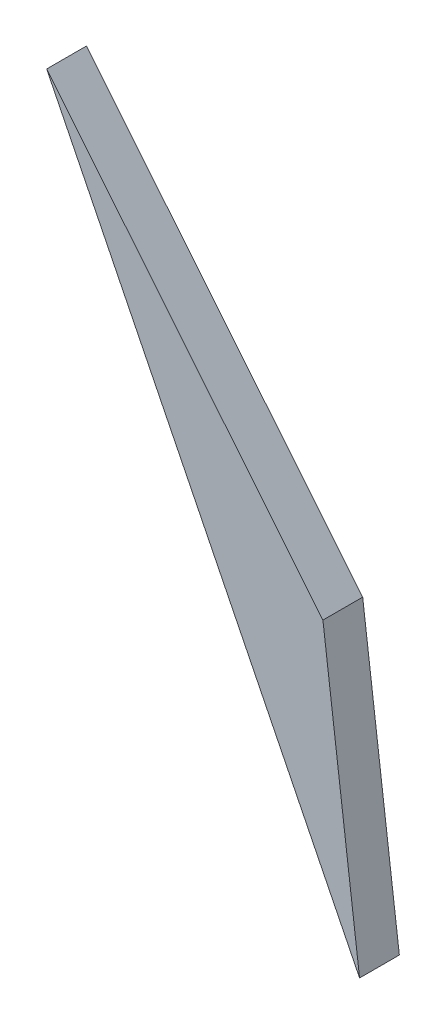
ISO-10303-21;
HEADER;
FILE_DESCRIPTION(('STEP AP214'),'2;1');
FILE_NAME('part.step','',(''),(''),'','','');
FILE_SCHEMA(('AUTOMOTIVE_DESIGN { 1 0 10303 214 1 1 1 1 }'));
ENDSEC;
DATA;
#1=APPLICATION_CONTEXT('core data for automotive mechanical design processes');
#2=APPLICATION_PROTOCOL_DEFINITION('international standard','automotive_design',2000,#1);
#3=PRODUCT_CONTEXT('',#1,'mechanical');
#4=PRODUCT('Part','Part','',(#3));
#5=PRODUCT_RELATED_PRODUCT_CATEGORY('part','',(#4));
#6=PRODUCT_DEFINITION_FORMATION('','',#4);
#7=PRODUCT_DEFINITION_CONTEXT('part definition',#1,'design');
#8=PRODUCT_DEFINITION('design','',#6,#7);
#9=PRODUCT_DEFINITION_SHAPE('','',#8);
#10=(LENGTH_UNIT() NAMED_UNIT(*) SI_UNIT(.MILLI.,.METRE.));
#11=(NAMED_UNIT(*) PLANE_ANGLE_UNIT() SI_UNIT($,.RADIAN.));
#12=(NAMED_UNIT(*) SI_UNIT($,.STERADIAN.) SOLID_ANGLE_UNIT());
#13=UNCERTAINTY_MEASURE_WITH_UNIT(LENGTH_MEASURE(1.E-05),#10,'distance_accuracy_value','');
#14=(GEOMETRIC_REPRESENTATION_CONTEXT(3) GLOBAL_UNCERTAINTY_ASSIGNED_CONTEXT((#13)) GLOBAL_UNIT_ASSIGNED_CONTEXT((#10,
#11,#12)) REPRESENTATION_CONTEXT('',''));
#15=CARTESIAN_POINT('',(0.,0.,0.));
#16=DIRECTION('',(0.,0.,1.));
#17=DIRECTION('',(1.,0.,0.));
#18=AXIS2_PLACEMENT_3D('',#15,#16,#17);
#19=CARTESIAN_POINT('',(-23.7102959440775,24.3585192257411,3.));
#20=DIRECTION('',(0.895829345995616,0.444398225528712,0.));
#21=DIRECTION('',(-0.444398225528712,0.895829345995616,0.));
#22=AXIS2_PLACEMENT_3D('',#19,#20,#21);
#23=PLANE('',#22);
#24=DIRECTION('',(0.444398225528712,-0.895829345995615,0.));
#25=VECTOR('',#24,1.);
#26=CARTESIAN_POINT('',(-23.7102959440775,24.3585192257411,0.));
#27=LINE('',#26,#25);
#28=CARTESIAN_POINT('',(-23.7102959440775,24.3585192257411,0.));
#29=VERTEX_POINT('',#28);
#30=CARTESIAN_POINT('',(-0.103997955508419,-23.2276619821565,0.));
#31=VERTEX_POINT('',#30);
#32=EDGE_CURVE('E80',#29,#31,#27,.T.);
#33=ORIENTED_EDGE('',*,*,#32,.T.);
#34=DIRECTION('',(0.,0.,-1.));
#35=VECTOR('',#34,1.);
#36=CARTESIAN_POINT('',(-0.103997955508419,-23.2276619821565,3.));
#37=LINE('',#36,#35);
#38=CARTESIAN_POINT('',(-0.103997955508419,-23.2276619821565,3.));
#39=VERTEX_POINT('',#38);
#40=EDGE_CURVE('E11',#39,#31,#37,.T.);
#41=ORIENTED_EDGE('',*,*,#40,.F.);
#42=DIRECTION('',(0.444398225528712,-0.895829345995615,0.));
#43=VECTOR('',#42,1.);
#44=CARTESIAN_POINT('',(-23.7102959440775,24.3585192257411,3.));
#45=LINE('',#44,#43);
#46=CARTESIAN_POINT('',(-23.7102959440775,24.3585192257411,3.));
#47=VERTEX_POINT('',#46);
#48=EDGE_CURVE('E73',#47,#39,#45,.T.);
#49=ORIENTED_EDGE('',*,*,#48,.F.);
#50=DIRECTION('',(0.,0.,-1.));
#51=VECTOR('',#50,1.);
#52=CARTESIAN_POINT('',(-23.7102959440775,24.3585192257411,3.));
#53=LINE('',#52,#51);
#54=EDGE_CURVE('E81',#47,#29,#53,.T.);
#55=ORIENTED_EDGE('',*,*,#54,.T.);
#56=EDGE_LOOP('',(#33,#41,#49,#55));
#57=FACE_BOUND('',#56,.T.);
#58=ADVANCED_FACE('F33',(#57),#23,.F.);
#59=CARTESIAN_POINT('',(-0.103997955508419,-23.2276619821565,3.));
#60=DIRECTION('',(-0.992192735918911,-0.124713971910708,0.));
#61=DIRECTION('',(0.124713971910708,-0.992192735918912,0.));
#62=AXIS2_PLACEMENT_3D('',#59,#60,#61);
#63=PLANE('',#62);
#64=DIRECTION('',(-0.124713971910708,0.992192735918912,0.));
#65=VECTOR('',#64,1.);
#66=CARTESIAN_POINT('',(-0.103997955508419,-23.2276619821565,0.));
#67=LINE('',#66,#65);
#68=CARTESIAN_POINT('',(-2.86929473980156,-1.22766198215647,0.));
#69=VERTEX_POINT('',#68);
#70=EDGE_CURVE('E61',#31,#69,#67,.T.);
#71=ORIENTED_EDGE('',*,*,#70,.T.);
#72=DIRECTION('',(0.,0.,-1.));
#73=VECTOR('',#72,1.);
#74=CARTESIAN_POINT('',(-2.86929473980156,-1.22766198215647,3.));
#75=LINE('',#74,#73);
#76=CARTESIAN_POINT('',(-2.86929473980156,-1.22766198215647,3.));
#77=VERTEX_POINT('',#76);
#78=EDGE_CURVE('E41',#77,#69,#75,.T.);
#79=ORIENTED_EDGE('',*,*,#78,.F.);
#80=DIRECTION('',(-0.124713971910708,0.992192735918912,0.));
#81=VECTOR('',#80,1.);
#82=CARTESIAN_POINT('',(-0.103997955508419,-23.2276619821565,3.));
#83=LINE('',#82,#81);
#84=EDGE_CURVE('E69',#39,#77,#83,.T.);
#85=ORIENTED_EDGE('',*,*,#84,.F.);
#86=ORIENTED_EDGE('',*,*,#40,.T.);
#87=EDGE_LOOP('',(#71,#79,#85,#86));
#88=FACE_BOUND('',#87,.T.);
#89=ADVANCED_FACE('F70',(#88),#63,.F.);
#90=CARTESIAN_POINT('',(-2.86929473980156,-1.22766198215647,3.));
#91=DIRECTION('',(-0.775338824481744,-0.631545491038663,0.));
#92=DIRECTION('',(0.631545491038664,-0.775338824481745,0.));
#93=AXIS2_PLACEMENT_3D('',#90,#91,#92);
#94=PLANE('',#93);
#95=DIRECTION('',(-0.631545491038664,0.775338824481745,0.));
#96=VECTOR('',#95,1.);
#97=CARTESIAN_POINT('',(-2.86929473980156,-1.22766198215647,0.));
#98=LINE('',#97,#96);
#99=EDGE_CURVE('E66',#69,#29,#98,.T.);
#100=ORIENTED_EDGE('',*,*,#99,.T.);
#101=ORIENTED_EDGE('',*,*,#54,.F.);
#102=DIRECTION('',(-0.631545491038664,0.775338824481745,0.));
#103=VECTOR('',#102,1.);
#104=CARTESIAN_POINT('',(-2.86929473980156,-1.22766198215647,3.));
#105=LINE('',#104,#103);
#106=EDGE_CURVE('E49',#77,#47,#105,.T.);
#107=ORIENTED_EDGE('',*,*,#106,.F.);
#108=ORIENTED_EDGE('',*,*,#78,.T.);
#109=EDGE_LOOP('',(#100,#101,#107,#108));
#110=FACE_BOUND('',#109,.T.);
#111=ADVANCED_FACE('F88',(#110),#94,.F.);
#112=CARTESIAN_POINT('',(0.,0.,3.));
#113=DIRECTION('',(0.,0.,1.));
#114=DIRECTION('',(1.,0.,0.));
#115=AXIS2_PLACEMENT_3D('',#112,#113,#114);
#116=PLANE('',#115);
#117=ORIENTED_EDGE('',*,*,#48,.T.);
#118=ORIENTED_EDGE('',*,*,#84,.T.);
#119=ORIENTED_EDGE('',*,*,#106,.T.);
#120=EDGE_LOOP('',(#117,#118,#119));
#121=FACE_BOUND('',#120,.T.);
#122=ADVANCED_FACE('F76',(#121),#116,.T.);
#123=CARTESIAN_POINT('',(0.,0.,0.));
#124=DIRECTION('',(0.,0.,1.));
#125=DIRECTION('',(1.,0.,0.));
#126=AXIS2_PLACEMENT_3D('',#123,#124,#125);
#127=PLANE('',#126);
#128=ORIENTED_EDGE('',*,*,#32,.F.);
#129=ORIENTED_EDGE('',*,*,#99,.F.);
#130=ORIENTED_EDGE('',*,*,#70,.F.);
#131=EDGE_LOOP('',(#128,#129,#130));
#132=FACE_BOUND('',#131,.T.);
#133=ADVANCED_FACE('F89',(#132),#127,.F.);
#134=CLOSED_SHELL('',(#58,#89,#111,#122,#133));
#135=MANIFOLD_SOLID_BREP('B2',#134);
#136=ADVANCED_BREP_SHAPE_REPRESENTATION('',(#18,#135),#14);
#137=SHAPE_DEFINITION_REPRESENTATION(#9,#136);
ENDSEC;
END-ISO-10303-21;
